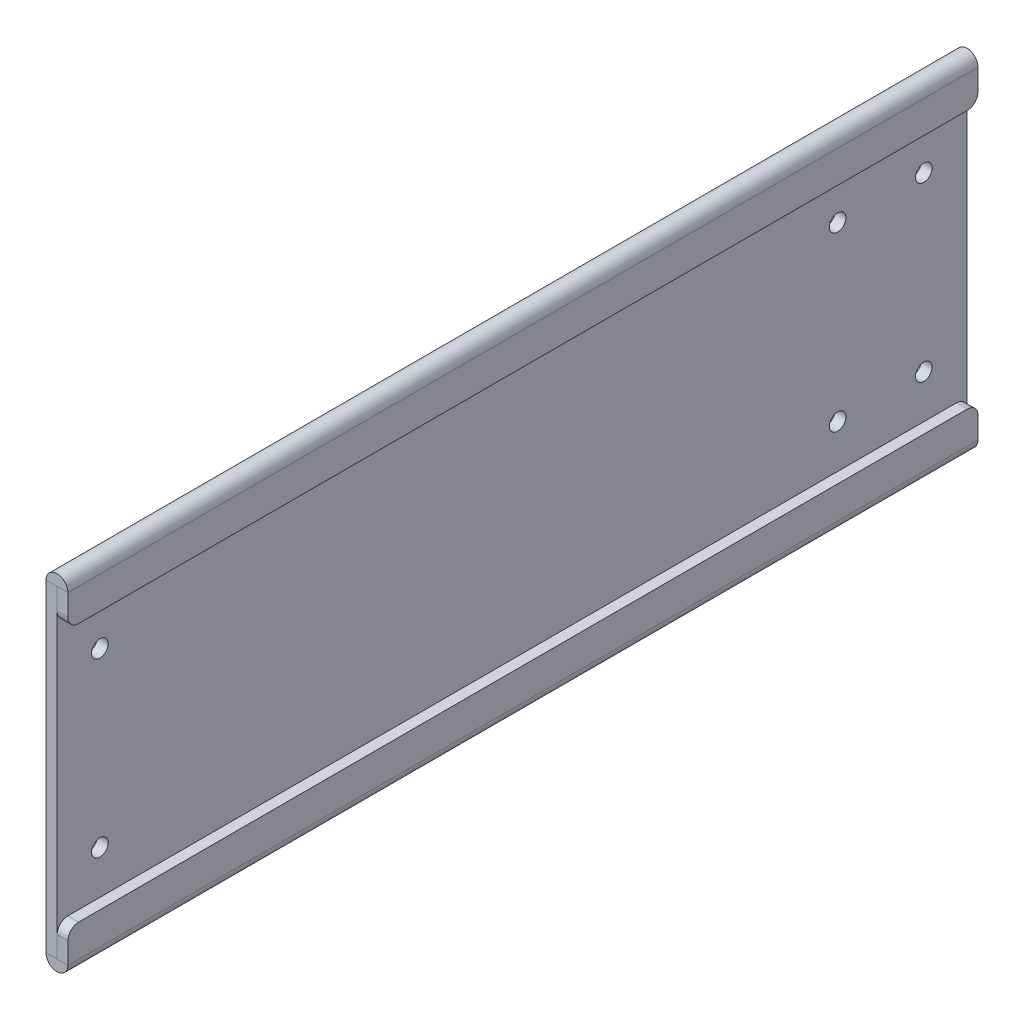
ISO-10303-21;
HEADER;
FILE_DESCRIPTION(('STEP AP214'),'2;1');
FILE_NAME('part.step','',(''),(''),'','','');
FILE_SCHEMA(('AUTOMOTIVE_DESIGN { 1 0 10303 214 1 1 1 1 }'));
ENDSEC;
DATA;
#1=APPLICATION_CONTEXT('core data for automotive mechanical design processes');
#2=APPLICATION_PROTOCOL_DEFINITION('international standard','automotive_design',2000,#1);
#3=PRODUCT_CONTEXT('',#1,'mechanical');
#4=PRODUCT('Part','Part','',(#3));
#5=PRODUCT_RELATED_PRODUCT_CATEGORY('part','',(#4));
#6=PRODUCT_DEFINITION_FORMATION('','',#4);
#7=PRODUCT_DEFINITION_CONTEXT('part definition',#1,'design');
#8=PRODUCT_DEFINITION('design','',#6,#7);
#9=PRODUCT_DEFINITION_SHAPE('','',#8);
#10=(LENGTH_UNIT() NAMED_UNIT(*) SI_UNIT(.MILLI.,.METRE.));
#11=(NAMED_UNIT(*) PLANE_ANGLE_UNIT() SI_UNIT($,.RADIAN.));
#12=(NAMED_UNIT(*) SI_UNIT($,.STERADIAN.) SOLID_ANGLE_UNIT());
#13=UNCERTAINTY_MEASURE_WITH_UNIT(LENGTH_MEASURE(1.E-05),#10,'distance_accuracy_value','');
#14=(GEOMETRIC_REPRESENTATION_CONTEXT(3) GLOBAL_UNCERTAINTY_ASSIGNED_CONTEXT((#13)) GLOBAL_UNIT_ASSIGNED_CONTEXT((#10,
#11,#12)) REPRESENTATION_CONTEXT('',''));
#15=CARTESIAN_POINT('',(0.,0.,0.));
#16=DIRECTION('',(0.,0.,1.));
#17=DIRECTION('',(1.,0.,0.));
#18=AXIS2_PLACEMENT_3D('',#15,#16,#17);
#19=CARTESIAN_POINT('',(0.,101.6,-268.22908));
#20=DIRECTION('',(0.,0.,-1.));
#21=DIRECTION('',(-1.,0.,0.));
#22=AXIS2_PLACEMENT_3D('',#19,#20,#21);
#23=PLANE('',#22);
#24=DIRECTION('',(0.,-1.,0.));
#25=VECTOR('',#24,1.);
#26=CARTESIAN_POINT('',(3.175,101.6,-268.22908));
#27=LINE('',#26,#25);
#28=CARTESIAN_POINT('',(3.175,98.375,-268.22908));
#29=VERTEX_POINT('',#28);
#30=CARTESIAN_POINT('',(3.175,3.22500000000001,-268.22908));
#31=VERTEX_POINT('',#30);
#32=EDGE_CURVE('E213',#29,#31,#27,.T.);
#33=ORIENTED_EDGE('',*,*,#32,.T.);
#34=DIRECTION('',(-1.,0.,0.));
#35=VECTOR('',#34,1.);
#36=CARTESIAN_POINT('',(3.175,3.225,-268.22908));
#37=LINE('',#36,#35);
#38=CARTESIAN_POINT('',(0.,3.22500000000003,-268.22908));
#39=VERTEX_POINT('',#38);
#40=EDGE_CURVE('E178',#31,#39,#37,.T.);
#41=ORIENTED_EDGE('',*,*,#40,.T.);
#42=DIRECTION('',(0.,-1.,0.));
#43=VECTOR('',#42,1.);
#44=CARTESIAN_POINT('',(0.,101.6,-268.22908));
#45=LINE('',#44,#43);
#46=CARTESIAN_POINT('',(0.,98.375,-268.22908));
#47=VERTEX_POINT('',#46);
#48=EDGE_CURVE('E198',#47,#39,#45,.T.);
#49=ORIENTED_EDGE('',*,*,#48,.F.);
#50=DIRECTION('',(-1.,0.,0.));
#51=VECTOR('',#50,1.);
#52=CARTESIAN_POINT('',(3.175,98.375,-268.22908));
#53=LINE('',#52,#51);
#54=EDGE_CURVE('E285',#29,#47,#53,.T.);
#55=ORIENTED_EDGE('',*,*,#54,.F.);
#56=EDGE_LOOP('',(#33,#41,#49,#55));
#57=FACE_BOUND('',#56,.T.);
#58=ADVANCED_FACE('F47',(#57),#23,.T.);
#59=CARTESIAN_POINT('',(3.175,101.6,0.));
#60=DIRECTION('',(0.,0.,1.));
#61=DIRECTION('',(1.,0.,0.));
#62=AXIS2_PLACEMENT_3D('',#59,#60,#61);
#63=PLANE('',#62);
#64=DIRECTION('',(-1.,0.,0.));
#65=VECTOR('',#64,1.);
#66=CARTESIAN_POINT('',(3.175,3.225,0.));
#67=LINE('',#66,#65);
#68=CARTESIAN_POINT('',(3.175,3.225,0.));
#69=VERTEX_POINT('',#68);
#70=CARTESIAN_POINT('',(0.,3.22500000000003,0.));
#71=VERTEX_POINT('',#70);
#72=EDGE_CURVE('E165',#69,#71,#67,.T.);
#73=ORIENTED_EDGE('',*,*,#72,.F.);
#74=DIRECTION('',(0.,-1.,0.));
#75=VECTOR('',#74,1.);
#76=CARTESIAN_POINT('',(3.175,101.6,0.));
#77=LINE('',#76,#75);
#78=CARTESIAN_POINT('',(3.175,98.375,0.));
#79=VERTEX_POINT('',#78);
#80=EDGE_CURVE('E208',#79,#69,#77,.T.);
#81=ORIENTED_EDGE('',*,*,#80,.F.);
#82=DIRECTION('',(-1.,0.,0.));
#83=VECTOR('',#82,1.);
#84=CARTESIAN_POINT('',(3.175,98.375,0.));
#85=LINE('',#84,#83);
#86=CARTESIAN_POINT('',(0.,98.375,0.));
#87=VERTEX_POINT('',#86);
#88=EDGE_CURVE('E206',#79,#87,#85,.T.);
#89=ORIENTED_EDGE('',*,*,#88,.T.);
#90=DIRECTION('',(0.,-1.,0.));
#91=VECTOR('',#90,1.);
#92=CARTESIAN_POINT('',(0.,101.6,0.));
#93=LINE('',#92,#91);
#94=EDGE_CURVE('E196',#87,#71,#93,.T.);
#95=ORIENTED_EDGE('',*,*,#94,.T.);
#96=EDGE_LOOP('',(#73,#81,#89,#95));
#97=FACE_BOUND('',#96,.T.);
#98=ADVANCED_FACE('F204',(#97),#63,.T.);
#99=CARTESIAN_POINT('',(3.175,101.6,0.));
#100=DIRECTION('',(-1.,0.,0.));
#101=DIRECTION('',(0.,0.,1.));
#102=AXIS2_PLACEMENT_3D('',#99,#100,#101);
#103=PLANE('',#102);
#104=CARTESIAN_POINT('',(3.175,25.35,-255.52908));
#105=DIRECTION('',(-1.,0.,0.));
#106=DIRECTION('',(0.,0.,1.));
#107=AXIS2_PLACEMENT_3D('',#104,#105,#106);
#108=CIRCLE('',#107,2.45745000000002);
#109=CARTESIAN_POINT('',(3.175,25.35,-253.07163));
#110=VERTEX_POINT('',#109);
#111=EDGE_CURVE('E410',#110,#110,#108,.T.);
#112=ORIENTED_EDGE('',*,*,#111,.T.);
#113=EDGE_LOOP('',(#112));
#114=FACE_BOUND('',#113,.T.);
#115=CARTESIAN_POINT('',(3.175,25.35,-230.12908));
#116=DIRECTION('',(-1.,0.,0.));
#117=DIRECTION('',(0.,0.,1.));
#118=AXIS2_PLACEMENT_3D('',#115,#116,#117);
#119=CIRCLE('',#118,2.45744999999999);
#120=CARTESIAN_POINT('',(3.175,25.35,-227.67163));
#121=VERTEX_POINT('',#120);
#122=EDGE_CURVE('E420',#121,#121,#119,.T.);
#123=ORIENTED_EDGE('',*,*,#122,.T.);
#124=EDGE_LOOP('',(#123));
#125=FACE_BOUND('',#124,.T.);
#126=CARTESIAN_POINT('',(3.175,76.15,-230.12908));
#127=DIRECTION('',(-1.,0.,0.));
#128=DIRECTION('',(0.,0.,1.));
#129=AXIS2_PLACEMENT_3D('',#126,#127,#128);
#130=CIRCLE('',#129,2.45744999999999);
#131=CARTESIAN_POINT('',(3.175,76.15,-227.67163));
#132=VERTEX_POINT('',#131);
#133=EDGE_CURVE('E424',#132,#132,#130,.T.);
#134=ORIENTED_EDGE('',*,*,#133,.T.);
#135=EDGE_LOOP('',(#134));
#136=FACE_BOUND('',#135,.T.);
#137=CARTESIAN_POINT('',(3.175,76.15,-12.7));
#138=DIRECTION('',(-1.,0.,0.));
#139=DIRECTION('',(0.,0.,1.));
#140=AXIS2_PLACEMENT_3D('',#137,#138,#139);
#141=CIRCLE('',#140,2.45745);
#142=CARTESIAN_POINT('',(3.175,76.15,-10.24255));
#143=VERTEX_POINT('',#142);
#144=EDGE_CURVE('E428',#143,#143,#141,.T.);
#145=ORIENTED_EDGE('',*,*,#144,.T.);
#146=EDGE_LOOP('',(#145));
#147=FACE_BOUND('',#146,.T.);
#148=CARTESIAN_POINT('',(3.175,25.35,-12.7));
#149=DIRECTION('',(-1.,0.,0.));
#150=DIRECTION('',(0.,0.,1.));
#151=AXIS2_PLACEMENT_3D('',#148,#149,#150);
#152=CIRCLE('',#151,2.45745);
#153=CARTESIAN_POINT('',(3.175,25.35,-10.24255));
#154=VERTEX_POINT('',#153);
#155=EDGE_CURVE('E432',#154,#154,#152,.T.);
#156=ORIENTED_EDGE('',*,*,#155,.T.);
#157=EDGE_LOOP('',(#156));
#158=FACE_BOUND('',#157,.T.);
#159=CARTESIAN_POINT('',(3.175,76.15,-255.52908));
#160=DIRECTION('',(-1.,0.,0.));
#161=DIRECTION('',(0.,0.,1.));
#162=AXIS2_PLACEMENT_3D('',#159,#160,#161);
#163=CIRCLE('',#162,2.45745000000002);
#164=CARTESIAN_POINT('',(3.175,76.15,-253.07163));
#165=VERTEX_POINT('',#164);
#166=EDGE_CURVE('E436',#165,#165,#163,.T.);
#167=ORIENTED_EDGE('',*,*,#166,.T.);
#168=EDGE_LOOP('',(#167));
#169=FACE_BOUND('',#168,.T.);
#170=ORIENTED_EDGE('',*,*,#80,.T.);
#171=DIRECTION('',(0.,0.,-1.));
#172=VECTOR('',#171,1.);
#173=CARTESIAN_POINT('',(3.175,3.225,-268.22908));
#174=LINE('',#173,#172);
#175=EDGE_CURVE('E409',#31,#69,#174,.F.);
#176=ORIENTED_EDGE('',*,*,#175,.F.);
#177=ORIENTED_EDGE('',*,*,#32,.F.);
#178=DIRECTION('',(0.,0.,1.));
#179=VECTOR('',#178,1.);
#180=CARTESIAN_POINT('',(3.175,98.375,0.));
#181=LINE('',#180,#179);
#182=EDGE_CURVE('E354',#79,#29,#181,.F.);
#183=ORIENTED_EDGE('',*,*,#182,.F.);
#184=EDGE_LOOP('',(#170,#176,#177,#183));
#185=FACE_BOUND('',#184,.T.);
#186=ADVANCED_FACE('F472',(#114,#125,#136,#147,#158,#169,#185),#103,.F.);
#187=CARTESIAN_POINT('',(0.,101.6,0.));
#188=DIRECTION('',(-1.,0.,0.));
#189=DIRECTION('',(0.,0.,1.));
#190=AXIS2_PLACEMENT_3D('',#187,#188,#189);
#191=PLANE('',#190);
#192=CARTESIAN_POINT('',(0.,25.35,-255.52908));
#193=DIRECTION('',(-1.,0.,0.));
#194=DIRECTION('',(0.,0.,1.));
#195=AXIS2_PLACEMENT_3D('',#192,#193,#194);
#196=CIRCLE('',#195,2.45745000000002);
#197=CARTESIAN_POINT('',(0.,25.35,-253.07163));
#198=VERTEX_POINT('',#197);
#199=EDGE_CURVE('E444',#198,#198,#196,.T.);
#200=ORIENTED_EDGE('',*,*,#199,.F.);
#201=EDGE_LOOP('',(#200));
#202=FACE_BOUND('',#201,.T.);
#203=CARTESIAN_POINT('',(0.,25.35,-230.12908));
#204=DIRECTION('',(-1.,0.,0.));
#205=DIRECTION('',(0.,0.,1.));
#206=AXIS2_PLACEMENT_3D('',#203,#204,#205);
#207=CIRCLE('',#206,2.45744999999999);
#208=CARTESIAN_POINT('',(0.,25.35,-227.67163));
#209=VERTEX_POINT('',#208);
#210=EDGE_CURVE('E454',#209,#209,#207,.T.);
#211=ORIENTED_EDGE('',*,*,#210,.F.);
#212=EDGE_LOOP('',(#211));
#213=FACE_BOUND('',#212,.T.);
#214=CARTESIAN_POINT('',(0.,76.15,-230.12908));
#215=DIRECTION('',(-1.,0.,0.));
#216=DIRECTION('',(0.,0.,1.));
#217=AXIS2_PLACEMENT_3D('',#214,#215,#216);
#218=CIRCLE('',#217,2.45744999999999);
#219=CARTESIAN_POINT('',(0.,76.15,-227.67163));
#220=VERTEX_POINT('',#219);
#221=EDGE_CURVE('E449',#220,#220,#218,.T.);
#222=ORIENTED_EDGE('',*,*,#221,.F.);
#223=EDGE_LOOP('',(#222));
#224=FACE_BOUND('',#223,.T.);
#225=CARTESIAN_POINT('',(0.,76.15,-12.7));
#226=DIRECTION('',(-1.,0.,0.));
#227=DIRECTION('',(0.,0.,1.));
#228=AXIS2_PLACEMENT_3D('',#225,#226,#227);
#229=CIRCLE('',#228,2.45745);
#230=CARTESIAN_POINT('',(0.,76.15,-10.24255));
#231=VERTEX_POINT('',#230);
#232=EDGE_CURVE('E445',#231,#231,#229,.T.);
#233=ORIENTED_EDGE('',*,*,#232,.F.);
#234=EDGE_LOOP('',(#233));
#235=FACE_BOUND('',#234,.T.);
#236=CARTESIAN_POINT('',(0.,25.35,-12.7));
#237=DIRECTION('',(-1.,0.,0.));
#238=DIRECTION('',(0.,0.,1.));
#239=AXIS2_PLACEMENT_3D('',#236,#237,#238);
#240=CIRCLE('',#239,2.45745);
#241=CARTESIAN_POINT('',(0.,25.35,-10.24255));
#242=VERTEX_POINT('',#241);
#243=EDGE_CURVE('E450',#242,#242,#240,.T.);
#244=ORIENTED_EDGE('',*,*,#243,.F.);
#245=EDGE_LOOP('',(#244));
#246=FACE_BOUND('',#245,.T.);
#247=CARTESIAN_POINT('',(0.,76.15,-255.52908));
#248=DIRECTION('',(-1.,0.,0.));
#249=DIRECTION('',(0.,0.,1.));
#250=AXIS2_PLACEMENT_3D('',#247,#248,#249);
#251=CIRCLE('',#250,2.45745000000002);
#252=CARTESIAN_POINT('',(0.,76.15,-253.07163));
#253=VERTEX_POINT('',#252);
#254=EDGE_CURVE('E440',#253,#253,#251,.T.);
#255=ORIENTED_EDGE('',*,*,#254,.F.);
#256=EDGE_LOOP('',(#255));
#257=FACE_BOUND('',#256,.T.);
#258=DIRECTION('',(0.,0.,-1.));
#259=VECTOR('',#258,1.);
#260=CARTESIAN_POINT('',(0.,3.22500000000003,-268.22908));
#261=LINE('',#260,#259);
#262=EDGE_CURVE('E185',#39,#71,#261,.F.);
#263=ORIENTED_EDGE('',*,*,#262,.T.);
#264=ORIENTED_EDGE('',*,*,#94,.F.);
#265=DIRECTION('',(0.,0.,1.));
#266=VECTOR('',#265,1.);
#267=CARTESIAN_POINT('',(0.,98.375,0.));
#268=LINE('',#267,#266);
#269=EDGE_CURVE('E341',#87,#47,#268,.F.);
#270=ORIENTED_EDGE('',*,*,#269,.T.);
#271=ORIENTED_EDGE('',*,*,#48,.T.);
#272=EDGE_LOOP('',(#263,#264,#270,#271));
#273=FACE_BOUND('',#272,.T.);
#274=ADVANCED_FACE('F194',(#202,#213,#224,#235,#246,#257,#273),#191,.T.);
#275=CARTESIAN_POINT('',(6.45,93.6375,0.));
#276=DIRECTION('',(0.,0.,-1.));
#277=DIRECTION('',(0.,1.,0.));
#278=AXIS2_PLACEMENT_3D('',#275,#276,#277);
#279=PLANE('',#278);
#280=DIRECTION('',(0.,1.,0.));
#281=VECTOR('',#280,1.);
#282=CARTESIAN_POINT('',(3.275,93.6375,0.));
#283=LINE('',#282,#281);
#284=CARTESIAN_POINT('',(3.275,92.075,0.));
#285=VERTEX_POINT('',#284);
#286=CARTESIAN_POINT('',(3.275,98.375,0.));
#287=VERTEX_POINT('',#286);
#288=EDGE_CURVE('E320',#285,#287,#283,.T.);
#289=ORIENTED_EDGE('',*,*,#288,.F.);
#290=DIRECTION('',(-1.,0.,0.));
#291=VECTOR('',#290,1.);
#292=CARTESIAN_POINT('',(6.45,92.075,0.));
#293=LINE('',#292,#291);
#294=CARTESIAN_POINT('',(6.45,92.075,0.));
#295=VERTEX_POINT('',#294);
#296=EDGE_CURVE('E222',#285,#295,#293,.F.);
#297=ORIENTED_EDGE('',*,*,#296,.T.);
#298=DIRECTION('',(0.,1.,0.));
#299=VECTOR('',#298,1.);
#300=CARTESIAN_POINT('',(6.45,93.6375,0.));
#301=LINE('',#300,#299);
#302=CARTESIAN_POINT('',(6.45,98.375,0.));
#303=VERTEX_POINT('',#302);
#304=EDGE_CURVE('E301',#295,#303,#301,.T.);
#305=ORIENTED_EDGE('',*,*,#304,.T.);
#306=DIRECTION('',(1.,0.,0.));
#307=VECTOR('',#306,1.);
#308=CARTESIAN_POINT('',(6.45,98.375,0.));
#309=LINE('',#308,#307);
#310=EDGE_CURVE('E300',#287,#303,#309,.T.);
#311=ORIENTED_EDGE('',*,*,#310,.F.);
#312=EDGE_LOOP('',(#289,#297,#305,#311));
#313=FACE_BOUND('',#312,.T.);
#314=ADVANCED_FACE('F471',(#313),#279,.F.);
#315=CARTESIAN_POINT('',(6.45,88.9,-134.11454));
#316=DIRECTION('',(0.,1.,0.));
#317=DIRECTION('',(0.,0.,1.));
#318=AXIS2_PLACEMENT_3D('',#315,#316,#317);
#319=PLANE('',#318);
#320=DIRECTION('',(0.,0.,1.));
#321=VECTOR('',#320,1.);
#322=CARTESIAN_POINT('',(6.45,88.9,-134.11454));
#323=LINE('',#322,#321);
#324=CARTESIAN_POINT('',(6.45,88.9,-265.05408));
#325=VERTEX_POINT('',#324);
#326=CARTESIAN_POINT('',(6.45,88.9,-3.17500000000001));
#327=VERTEX_POINT('',#326);
#328=EDGE_CURVE('E293',#325,#327,#323,.T.);
#329=ORIENTED_EDGE('',*,*,#328,.T.);
#330=DIRECTION('',(-1.,0.,0.));
#331=VECTOR('',#330,1.);
#332=CARTESIAN_POINT('',(6.45,88.9,-3.17500000000001));
#333=LINE('',#332,#331);
#334=CARTESIAN_POINT('',(3.275,88.9,-3.17500000000001));
#335=VERTEX_POINT('',#334);
#336=EDGE_CURVE('E236',#327,#335,#333,.T.);
#337=ORIENTED_EDGE('',*,*,#336,.T.);
#338=DIRECTION('',(0.,0.,-1.));
#339=VECTOR('',#338,1.);
#340=CARTESIAN_POINT('',(3.275,88.9,-134.11454));
#341=LINE('',#340,#339);
#342=CARTESIAN_POINT('',(3.275,88.9,-265.05408));
#343=VERTEX_POINT('',#342);
#344=EDGE_CURVE('E295',#343,#335,#341,.F.);
#345=ORIENTED_EDGE('',*,*,#344,.F.);
#346=DIRECTION('',(-1.,0.,0.));
#347=VECTOR('',#346,1.);
#348=CARTESIAN_POINT('',(6.45,88.9,-265.05408));
#349=LINE('',#348,#347);
#350=EDGE_CURVE('E232',#343,#325,#349,.F.);
#351=ORIENTED_EDGE('',*,*,#350,.T.);
#352=EDGE_LOOP('',(#329,#337,#345,#351));
#353=FACE_BOUND('',#352,.T.);
#354=ADVANCED_FACE('F292',(#353),#319,.F.);
#355=CARTESIAN_POINT('',(6.45,93.6375,-268.22908));
#356=DIRECTION('',(0.,0.,1.));
#357=DIRECTION('',(0.,-1.,0.));
#358=AXIS2_PLACEMENT_3D('',#355,#356,#357);
#359=PLANE('',#358);
#360=DIRECTION('',(0.,-1.,0.));
#361=VECTOR('',#360,1.);
#362=CARTESIAN_POINT('',(6.45,93.6375,-268.22908));
#363=LINE('',#362,#361);
#364=CARTESIAN_POINT('',(6.45,98.375,-268.22908));
#365=VERTEX_POINT('',#364);
#366=CARTESIAN_POINT('',(6.45,92.075,-268.22908));
#367=VERTEX_POINT('',#366);
#368=EDGE_CURVE('E275',#365,#367,#363,.T.);
#369=ORIENTED_EDGE('',*,*,#368,.T.);
#370=DIRECTION('',(-1.,0.,0.));
#371=VECTOR('',#370,1.);
#372=CARTESIAN_POINT('',(6.45,92.075,-268.22908));
#373=LINE('',#372,#371);
#374=CARTESIAN_POINT('',(3.275,92.075,-268.22908));
#375=VERTEX_POINT('',#374);
#376=EDGE_CURVE('E56',#367,#375,#373,.T.);
#377=ORIENTED_EDGE('',*,*,#376,.T.);
#378=DIRECTION('',(0.,1.,0.));
#379=VECTOR('',#378,1.);
#380=CARTESIAN_POINT('',(3.275,93.6375,-268.22908));
#381=LINE('',#380,#379);
#382=CARTESIAN_POINT('',(3.275,98.375,-268.22908));
#383=VERTEX_POINT('',#382);
#384=EDGE_CURVE('E273',#383,#375,#381,.F.);
#385=ORIENTED_EDGE('',*,*,#384,.F.);
#386=DIRECTION('',(1.,0.,0.));
#387=VECTOR('',#386,1.);
#388=CARTESIAN_POINT('',(6.45,98.375,-268.22908));
#389=LINE('',#388,#387);
#390=EDGE_CURVE('E215',#383,#365,#389,.T.);
#391=ORIENTED_EDGE('',*,*,#390,.T.);
#392=EDGE_LOOP('',(#369,#377,#385,#391));
#393=FACE_BOUND('',#392,.T.);
#394=ADVANCED_FACE('F271',(#393),#359,.F.);
#395=CARTESIAN_POINT('',(6.45,93.6375,-134.11454));
#396=DIRECTION('',(1.,0.,0.));
#397=DIRECTION('',(0.,0.,-1.));
#398=AXIS2_PLACEMENT_3D('',#395,#396,#397);
#399=PLANE('',#398);
#400=ORIENTED_EDGE('',*,*,#304,.F.);
#401=CARTESIAN_POINT('',(6.45,92.075,-3.175));
#402=DIRECTION('',(1.,0.,0.));
#403=DIRECTION('',(0.,0.,-1.));
#404=AXIS2_PLACEMENT_3D('',#401,#402,#403);
#405=CIRCLE('',#404,3.175);
#406=EDGE_CURVE('E229',#295,#327,#405,.T.);
#407=ORIENTED_EDGE('',*,*,#406,.T.);
#408=ORIENTED_EDGE('',*,*,#328,.F.);
#409=CARTESIAN_POINT('',(6.45,92.075,-265.05408));
#410=DIRECTION('',(1.,0.,0.));
#411=DIRECTION('',(0.,0.,-1.));
#412=AXIS2_PLACEMENT_3D('',#409,#410,#411);
#413=CIRCLE('',#412,3.175);
#414=EDGE_CURVE('E226',#325,#367,#413,.T.);
#415=ORIENTED_EDGE('',*,*,#414,.T.);
#416=ORIENTED_EDGE('',*,*,#368,.F.);
#417=DIRECTION('',(0.,0.,-1.));
#418=VECTOR('',#417,1.);
#419=CARTESIAN_POINT('',(6.45,98.375,-134.11454));
#420=LINE('',#419,#418);
#421=EDGE_CURVE('E308',#303,#365,#420,.T.);
#422=ORIENTED_EDGE('',*,*,#421,.F.);
#423=EDGE_LOOP('',(#400,#407,#408,#415,#416,#422));
#424=FACE_BOUND('',#423,.T.);
#425=ADVANCED_FACE('F298',(#424),#399,.T.);
#426=CARTESIAN_POINT('',(3.275,93.6375,-134.11454));
#427=DIRECTION('',(1.,0.,0.));
#428=DIRECTION('',(0.,0.,-1.));
#429=AXIS2_PLACEMENT_3D('',#426,#427,#428);
#430=PLANE('',#429);
#431=ORIENTED_EDGE('',*,*,#344,.T.);
#432=CARTESIAN_POINT('',(3.275,92.075,-3.175));
#433=DIRECTION('',(1.,0.,0.));
#434=DIRECTION('',(0.,0.,-1.));
#435=AXIS2_PLACEMENT_3D('',#432,#433,#434);
#436=CIRCLE('',#435,3.175);
#437=EDGE_CURVE('E242',#335,#285,#436,.F.);
#438=ORIENTED_EDGE('',*,*,#437,.T.);
#439=ORIENTED_EDGE('',*,*,#288,.T.);
#440=DIRECTION('',(0.,0.,-1.));
#441=VECTOR('',#440,1.);
#442=CARTESIAN_POINT('',(3.275,98.375,-134.11454));
#443=LINE('',#442,#441);
#444=EDGE_CURVE('E283',#287,#383,#443,.T.);
#445=ORIENTED_EDGE('',*,*,#444,.T.);
#446=ORIENTED_EDGE('',*,*,#384,.T.);
#447=CARTESIAN_POINT('',(3.275,92.075,-265.05408));
#448=DIRECTION('',(1.,0.,0.));
#449=DIRECTION('',(0.,0.,-1.));
#450=AXIS2_PLACEMENT_3D('',#447,#448,#449);
#451=CIRCLE('',#450,3.175);
#452=EDGE_CURVE('E239',#375,#343,#451,.F.);
#453=ORIENTED_EDGE('',*,*,#452,.T.);
#454=EDGE_LOOP('',(#431,#438,#439,#445,#446,#453));
#455=FACE_BOUND('',#454,.T.);
#456=ADVANCED_FACE('F280',(#455),#430,.F.);
#457=CARTESIAN_POINT('',(3.225,98.375,-268.22908));
#458=DIRECTION('',(0.,0.,-1.));
#459=DIRECTION('',(-1.,0.,0.));
#460=AXIS2_PLACEMENT_3D('',#457,#458,#459);
#461=PLANE('',#460);
#462=ORIENTED_EDGE('',*,*,#390,.F.);
#463=CARTESIAN_POINT('',(3.225,98.375,-268.22908));
#464=DIRECTION('',(0.,0.,1.));
#465=DIRECTION('',(1.,0.,0.));
#466=AXIS2_PLACEMENT_3D('',#463,#464,#465);
#467=CIRCLE('',#466,0.0499999999999997);
#468=EDGE_CURVE('E351',#29,#383,#467,.F.);
#469=ORIENTED_EDGE('',*,*,#468,.F.);
#470=ORIENTED_EDGE('',*,*,#54,.T.);
#471=CARTESIAN_POINT('',(3.225,98.375,-268.22908));
#472=DIRECTION('',(0.,0.,1.));
#473=DIRECTION('',(1.,0.,0.));
#474=AXIS2_PLACEMENT_3D('',#471,#472,#473);
#475=CIRCLE('',#474,3.225);
#476=EDGE_CURVE('E335',#47,#365,#475,.F.);
#477=ORIENTED_EDGE('',*,*,#476,.T.);
#478=EDGE_LOOP('',(#462,#469,#470,#477));
#479=FACE_BOUND('',#478,.T.);
#480=ADVANCED_FACE('F338',(#479),#461,.T.);
#481=CARTESIAN_POINT('',(3.225,98.375,0.));
#482=DIRECTION('',(0.,0.,-1.));
#483=DIRECTION('',(-1.,0.,0.));
#484=AXIS2_PLACEMENT_3D('',#481,#482,#483);
#485=PLANE('',#484);
#486=CARTESIAN_POINT('',(3.225,98.375,0.));
#487=DIRECTION('',(0.,0.,1.));
#488=DIRECTION('',(1.,0.,0.));
#489=AXIS2_PLACEMENT_3D('',#486,#487,#488);
#490=CIRCLE('',#489,0.0499999999999997);
#491=EDGE_CURVE('E357',#287,#79,#490,.T.);
#492=ORIENTED_EDGE('',*,*,#491,.F.);
#493=ORIENTED_EDGE('',*,*,#310,.T.);
#494=CARTESIAN_POINT('',(3.225,98.375,0.));
#495=DIRECTION('',(0.,0.,1.));
#496=DIRECTION('',(1.,0.,0.));
#497=AXIS2_PLACEMENT_3D('',#494,#495,#496);
#498=CIRCLE('',#497,3.225);
#499=EDGE_CURVE('E337',#303,#87,#498,.T.);
#500=ORIENTED_EDGE('',*,*,#499,.T.);
#501=ORIENTED_EDGE('',*,*,#88,.F.);
#502=EDGE_LOOP('',(#492,#493,#500,#501));
#503=FACE_BOUND('',#502,.T.);
#504=ADVANCED_FACE('F776',(#503),#485,.F.);
#505=CARTESIAN_POINT('',(3.225,98.375,0.));
#506=DIRECTION('',(0.,0.,1.));
#507=DIRECTION('',(1.,0.,0.));
#508=AXIS2_PLACEMENT_3D('',#505,#506,#507);
#509=CYLINDRICAL_SURFACE('',#508,3.225);
#510=ORIENTED_EDGE('',*,*,#269,.F.);
#511=ORIENTED_EDGE('',*,*,#499,.F.);
#512=ORIENTED_EDGE('',*,*,#421,.T.);
#513=ORIENTED_EDGE('',*,*,#476,.F.);
#514=EDGE_LOOP('',(#510,#511,#512,#513));
#515=FACE_BOUND('',#514,.T.);
#516=ADVANCED_FACE('F334',(#515),#509,.T.);
#517=CARTESIAN_POINT('',(3.225,98.375,0.));
#518=DIRECTION('',(0.,0.,1.));
#519=DIRECTION('',(1.,0.,0.));
#520=AXIS2_PLACEMENT_3D('',#517,#518,#519);
#521=CYLINDRICAL_SURFACE('',#520,0.0499999999999997);
#522=ORIENTED_EDGE('',*,*,#182,.T.);
#523=ORIENTED_EDGE('',*,*,#468,.T.);
#524=ORIENTED_EDGE('',*,*,#444,.F.);
#525=ORIENTED_EDGE('',*,*,#491,.T.);
#526=EDGE_LOOP('',(#522,#523,#524,#525));
#527=FACE_BOUND('',#526,.T.);
#528=ADVANCED_FACE('F491',(#527),#521,.F.);
#529=CARTESIAN_POINT('',(6.45,7.9625,-268.22908));
#530=DIRECTION('',(0.,0.,1.));
#531=DIRECTION('',(0.,-1.,0.));
#532=AXIS2_PLACEMENT_3D('',#529,#530,#531);
#533=PLANE('',#532);
#534=DIRECTION('',(0.,1.,0.));
#535=VECTOR('',#534,1.);
#536=CARTESIAN_POINT('',(3.275,7.9625,-268.22908));
#537=LINE('',#536,#535);
#538=CARTESIAN_POINT('',(3.275,9.525,-268.22908));
#539=VERTEX_POINT('',#538);
#540=CARTESIAN_POINT('',(3.275,3.225,-268.22908));
#541=VERTEX_POINT('',#540);
#542=EDGE_CURVE('E387',#539,#541,#537,.F.);
#543=ORIENTED_EDGE('',*,*,#542,.F.);
#544=DIRECTION('',(-1.,0.,0.));
#545=VECTOR('',#544,1.);
#546=CARTESIAN_POINT('',(6.45,9.525,-268.22908));
#547=LINE('',#546,#545);
#548=CARTESIAN_POINT('',(6.45,9.525,-268.22908));
#549=VERTEX_POINT('',#548);
#550=EDGE_CURVE('E11',#539,#549,#547,.F.);
#551=ORIENTED_EDGE('',*,*,#550,.T.);
#552=DIRECTION('',(0.,-1.,0.));
#553=VECTOR('',#552,1.);
#554=CARTESIAN_POINT('',(6.45,7.9625,-268.22908));
#555=LINE('',#554,#553);
#556=CARTESIAN_POINT('',(6.45,3.225,-268.22908));
#557=VERTEX_POINT('',#556);
#558=EDGE_CURVE('E398',#549,#557,#555,.T.);
#559=ORIENTED_EDGE('',*,*,#558,.T.);
#560=DIRECTION('',(1.,0.,0.));
#561=VECTOR('',#560,1.);
#562=CARTESIAN_POINT('',(6.45,3.225,-268.22908));
#563=LINE('',#562,#561);
#564=EDGE_CURVE('E375',#541,#557,#563,.T.);
#565=ORIENTED_EDGE('',*,*,#564,.F.);
#566=EDGE_LOOP('',(#543,#551,#559,#565));
#567=FACE_BOUND('',#566,.T.);
#568=ADVANCED_FACE('F500',(#567),#533,.F.);
#569=CARTESIAN_POINT('',(6.45,12.7,-134.11454));
#570=DIRECTION('',(0.,-1.,0.));
#571=DIRECTION('',(0.,0.,-1.));
#572=AXIS2_PLACEMENT_3D('',#569,#570,#571);
#573=PLANE('',#572);
#574=DIRECTION('',(0.,0.,-1.));
#575=VECTOR('',#574,1.);
#576=CARTESIAN_POINT('',(3.275,12.7,-134.11454));
#577=LINE('',#576,#575);
#578=CARTESIAN_POINT('',(3.275,12.7,-3.17500000000001));
#579=VERTEX_POINT('',#578);
#580=CARTESIAN_POINT('',(3.275,12.7,-265.05408));
#581=VERTEX_POINT('',#580);
#582=EDGE_CURVE('E390',#579,#581,#577,.T.);
#583=ORIENTED_EDGE('',*,*,#582,.F.);
#584=DIRECTION('',(-1.,0.,0.));
#585=VECTOR('',#584,1.);
#586=CARTESIAN_POINT('',(6.45,12.7,-3.17500000000001));
#587=LINE('',#586,#585);
#588=CARTESIAN_POINT('',(6.45,12.7,-3.17500000000001));
#589=VERTEX_POINT('',#588);
#590=EDGE_CURVE('E248',#579,#589,#587,.F.);
#591=ORIENTED_EDGE('',*,*,#590,.T.);
#592=DIRECTION('',(0.,0.,-1.));
#593=VECTOR('',#592,1.);
#594=CARTESIAN_POINT('',(6.45,12.7,-134.11454));
#595=LINE('',#594,#593);
#596=CARTESIAN_POINT('',(6.45,12.7,-265.05408));
#597=VERTEX_POINT('',#596);
#598=EDGE_CURVE('E379',#589,#597,#595,.T.);
#599=ORIENTED_EDGE('',*,*,#598,.T.);
#600=DIRECTION('',(-1.,0.,0.));
#601=VECTOR('',#600,1.);
#602=CARTESIAN_POINT('',(6.45,12.7,-265.05408));
#603=LINE('',#602,#601);
#604=EDGE_CURVE('E245',#597,#581,#603,.T.);
#605=ORIENTED_EDGE('',*,*,#604,.T.);
#606=EDGE_LOOP('',(#583,#591,#599,#605));
#607=FACE_BOUND('',#606,.T.);
#608=ADVANCED_FACE('F509',(#607),#573,.F.);
#609=CARTESIAN_POINT('',(6.45,7.9625,0.));
#610=DIRECTION('',(0.,0.,-1.));
#611=DIRECTION('',(0.,1.,0.));
#612=AXIS2_PLACEMENT_3D('',#609,#610,#611);
#613=PLANE('',#612);
#614=DIRECTION('',(0.,1.,0.));
#615=VECTOR('',#614,1.);
#616=CARTESIAN_POINT('',(6.45,7.9625,0.));
#617=LINE('',#616,#615);
#618=CARTESIAN_POINT('',(6.45,3.225,0.));
#619=VERTEX_POINT('',#618);
#620=CARTESIAN_POINT('',(6.45,9.525,0.));
#621=VERTEX_POINT('',#620);
#622=EDGE_CURVE('E393',#619,#621,#617,.T.);
#623=ORIENTED_EDGE('',*,*,#622,.T.);
#624=DIRECTION('',(-1.,0.,0.));
#625=VECTOR('',#624,1.);
#626=CARTESIAN_POINT('',(6.45,9.525,0.));
#627=LINE('',#626,#625);
#628=CARTESIAN_POINT('',(3.275,9.525,0.));
#629=VERTEX_POINT('',#628);
#630=EDGE_CURVE('E71',#621,#629,#627,.T.);
#631=ORIENTED_EDGE('',*,*,#630,.T.);
#632=DIRECTION('',(0.,1.,0.));
#633=VECTOR('',#632,1.);
#634=CARTESIAN_POINT('',(3.275,7.9625,0.));
#635=LINE('',#634,#633);
#636=CARTESIAN_POINT('',(3.275,3.225,0.));
#637=VERTEX_POINT('',#636);
#638=EDGE_CURVE('E177',#637,#629,#635,.T.);
#639=ORIENTED_EDGE('',*,*,#638,.F.);
#640=DIRECTION('',(1.,0.,0.));
#641=VECTOR('',#640,1.);
#642=CARTESIAN_POINT('',(6.45,3.225,0.));
#643=LINE('',#642,#641);
#644=EDGE_CURVE('E359',#637,#619,#643,.T.);
#645=ORIENTED_EDGE('',*,*,#644,.T.);
#646=EDGE_LOOP('',(#623,#631,#639,#645));
#647=FACE_BOUND('',#646,.T.);
#648=ADVANCED_FACE('F506',(#647),#613,.F.);
#649=CARTESIAN_POINT('',(6.45,7.9625,-134.11454));
#650=DIRECTION('',(1.,0.,0.));
#651=DIRECTION('',(0.,0.,-1.));
#652=AXIS2_PLACEMENT_3D('',#649,#650,#651);
#653=PLANE('',#652);
#654=ORIENTED_EDGE('',*,*,#598,.F.);
#655=CARTESIAN_POINT('',(6.45,9.525,-3.17500000000001));
#656=DIRECTION('',(1.,0.,0.));
#657=DIRECTION('',(0.,0.,-1.));
#658=AXIS2_PLACEMENT_3D('',#655,#656,#657);
#659=CIRCLE('',#658,3.175);
#660=EDGE_CURVE('E255',#589,#621,#659,.T.);
#661=ORIENTED_EDGE('',*,*,#660,.T.);
#662=ORIENTED_EDGE('',*,*,#622,.F.);
#663=DIRECTION('',(0.,0.,1.));
#664=VECTOR('',#663,1.);
#665=CARTESIAN_POINT('',(6.45,3.225,-134.11454));
#666=LINE('',#665,#664);
#667=EDGE_CURVE('E188',#557,#619,#666,.T.);
#668=ORIENTED_EDGE('',*,*,#667,.F.);
#669=ORIENTED_EDGE('',*,*,#558,.F.);
#670=CARTESIAN_POINT('',(6.45,9.525,-265.05408));
#671=DIRECTION('',(1.,0.,0.));
#672=DIRECTION('',(0.,0.,-1.));
#673=AXIS2_PLACEMENT_3D('',#670,#671,#672);
#674=CIRCLE('',#673,3.175);
#675=EDGE_CURVE('E252',#549,#597,#674,.T.);
#676=ORIENTED_EDGE('',*,*,#675,.T.);
#677=EDGE_LOOP('',(#654,#661,#662,#668,#669,#676));
#678=FACE_BOUND('',#677,.T.);
#679=ADVANCED_FACE('F508',(#678),#653,.T.);
#680=CARTESIAN_POINT('',(3.275,7.9625,-134.11454));
#681=DIRECTION('',(1.,0.,0.));
#682=DIRECTION('',(0.,0.,-1.));
#683=AXIS2_PLACEMENT_3D('',#680,#681,#682);
#684=PLANE('',#683);
#685=ORIENTED_EDGE('',*,*,#638,.T.);
#686=CARTESIAN_POINT('',(3.275,9.525,-3.17500000000001));
#687=DIRECTION('',(1.,0.,0.));
#688=DIRECTION('',(0.,0.,-1.));
#689=AXIS2_PLACEMENT_3D('',#686,#687,#688);
#690=CIRCLE('',#689,3.175);
#691=EDGE_CURVE('E262',#629,#579,#690,.F.);
#692=ORIENTED_EDGE('',*,*,#691,.T.);
#693=ORIENTED_EDGE('',*,*,#582,.T.);
#694=CARTESIAN_POINT('',(3.275,9.525,-265.05408));
#695=DIRECTION('',(1.,0.,0.));
#696=DIRECTION('',(0.,0.,-1.));
#697=AXIS2_PLACEMENT_3D('',#694,#695,#696);
#698=CIRCLE('',#697,3.175);
#699=EDGE_CURVE('E63',#581,#539,#698,.F.);
#700=ORIENTED_EDGE('',*,*,#699,.T.);
#701=ORIENTED_EDGE('',*,*,#542,.T.);
#702=DIRECTION('',(0.,0.,-1.));
#703=VECTOR('',#702,1.);
#704=CARTESIAN_POINT('',(3.275,3.225,-134.11454));
#705=LINE('',#704,#703);
#706=EDGE_CURVE('E384',#541,#637,#705,.F.);
#707=ORIENTED_EDGE('',*,*,#706,.T.);
#708=EDGE_LOOP('',(#685,#692,#693,#700,#701,#707));
#709=FACE_BOUND('',#708,.T.);
#710=ADVANCED_FACE('F504',(#709),#684,.F.);
#711=CARTESIAN_POINT('',(3.225,3.225,0.));
#712=DIRECTION('',(0.,0.,1.));
#713=DIRECTION('',(1.,0.,0.));
#714=AXIS2_PLACEMENT_3D('',#711,#712,#713);
#715=PLANE('',#714);
#716=ORIENTED_EDGE('',*,*,#644,.F.);
#717=CARTESIAN_POINT('',(3.225,3.225,0.));
#718=DIRECTION('',(0.,0.,-1.));
#719=DIRECTION('',(-1.,0.,0.));
#720=AXIS2_PLACEMENT_3D('',#717,#718,#719);
#721=CIRCLE('',#720,0.0499999999999997);
#722=EDGE_CURVE('E171',#69,#637,#721,.F.);
#723=ORIENTED_EDGE('',*,*,#722,.F.);
#724=ORIENTED_EDGE('',*,*,#72,.T.);
#725=CARTESIAN_POINT('',(3.225,3.225,0.));
#726=DIRECTION('',(0.,0.,-1.));
#727=DIRECTION('',(-1.,0.,0.));
#728=AXIS2_PLACEMENT_3D('',#725,#726,#727);
#729=CIRCLE('',#728,3.225);
#730=EDGE_CURVE('E169',#71,#619,#729,.F.);
#731=ORIENTED_EDGE('',*,*,#730,.T.);
#732=EDGE_LOOP('',(#716,#723,#724,#731));
#733=FACE_BOUND('',#732,.T.);
#734=ADVANCED_FACE('F168',(#733),#715,.T.);
#735=CARTESIAN_POINT('',(3.225,3.225,-268.22908));
#736=DIRECTION('',(0.,0.,1.));
#737=DIRECTION('',(1.,0.,0.));
#738=AXIS2_PLACEMENT_3D('',#735,#736,#737);
#739=PLANE('',#738);
#740=CARTESIAN_POINT('',(3.225,3.225,-268.22908));
#741=DIRECTION('',(0.,0.,-1.));
#742=DIRECTION('',(-1.,0.,0.));
#743=AXIS2_PLACEMENT_3D('',#740,#741,#742);
#744=CIRCLE('',#743,0.0499999999999997);
#745=EDGE_CURVE('E406',#541,#31,#744,.T.);
#746=ORIENTED_EDGE('',*,*,#745,.F.);
#747=ORIENTED_EDGE('',*,*,#564,.T.);
#748=CARTESIAN_POINT('',(3.225,3.225,-268.22908));
#749=DIRECTION('',(0.,0.,-1.));
#750=DIRECTION('',(-1.,0.,0.));
#751=AXIS2_PLACEMENT_3D('',#748,#749,#750);
#752=CIRCLE('',#751,3.225);
#753=EDGE_CURVE('E201',#557,#39,#752,.T.);
#754=ORIENTED_EDGE('',*,*,#753,.T.);
#755=ORIENTED_EDGE('',*,*,#40,.F.);
#756=EDGE_LOOP('',(#746,#747,#754,#755));
#757=FACE_BOUND('',#756,.T.);
#758=ADVANCED_FACE('F496',(#757),#739,.F.);
#759=CARTESIAN_POINT('',(3.225,3.225,-268.22908));
#760=DIRECTION('',(0.,0.,-1.));
#761=DIRECTION('',(1.,0.,0.));
#762=AXIS2_PLACEMENT_3D('',#759,#760,#761);
#763=CYLINDRICAL_SURFACE('',#762,3.225);
#764=ORIENTED_EDGE('',*,*,#262,.F.);
#765=ORIENTED_EDGE('',*,*,#753,.F.);
#766=ORIENTED_EDGE('',*,*,#667,.T.);
#767=ORIENTED_EDGE('',*,*,#730,.F.);
#768=EDGE_LOOP('',(#764,#765,#766,#767));
#769=FACE_BOUND('',#768,.T.);
#770=ADVANCED_FACE('F183',(#769),#763,.T.);
#771=CARTESIAN_POINT('',(3.225,3.225,-268.22908));
#772=DIRECTION('',(0.,0.,-1.));
#773=DIRECTION('',(1.,0.,0.));
#774=AXIS2_PLACEMENT_3D('',#771,#772,#773);
#775=CYLINDRICAL_SURFACE('',#774,0.0499999999999997);
#776=ORIENTED_EDGE('',*,*,#175,.T.);
#777=ORIENTED_EDGE('',*,*,#722,.T.);
#778=ORIENTED_EDGE('',*,*,#706,.F.);
#779=ORIENTED_EDGE('',*,*,#745,.T.);
#780=EDGE_LOOP('',(#776,#777,#778,#779));
#781=FACE_BOUND('',#780,.T.);
#782=ADVANCED_FACE('F480',(#781),#775,.F.);
#783=CARTESIAN_POINT('',(6.45,76.15,-255.52908));
#784=DIRECTION('',(-1.,0.,0.));
#785=DIRECTION('',(0.,0.,1.));
#786=AXIS2_PLACEMENT_3D('',#783,#784,#785);
#787=CYLINDRICAL_SURFACE('',#786,2.45745000000002);
#788=ORIENTED_EDGE('',*,*,#254,.T.);
#789=EDGE_LOOP('',(#788));
#790=FACE_BOUND('',#789,.T.);
#791=ORIENTED_EDGE('',*,*,#166,.F.);
#792=EDGE_LOOP('',(#791));
#793=FACE_BOUND('',#792,.T.);
#794=ADVANCED_FACE('F477',(#790,#793),#787,.F.);
#795=CARTESIAN_POINT('',(6.45,25.35,-12.7));
#796=DIRECTION('',(-1.,0.,0.));
#797=DIRECTION('',(0.,0.,1.));
#798=AXIS2_PLACEMENT_3D('',#795,#796,#797);
#799=CYLINDRICAL_SURFACE('',#798,2.45745);
#800=ORIENTED_EDGE('',*,*,#243,.T.);
#801=EDGE_LOOP('',(#800));
#802=FACE_BOUND('',#801,.T.);
#803=ORIENTED_EDGE('',*,*,#155,.F.);
#804=EDGE_LOOP('',(#803));
#805=FACE_BOUND('',#804,.T.);
#806=ADVANCED_FACE('F466',(#802,#805),#799,.F.);
#807=CARTESIAN_POINT('',(6.45,76.15,-12.7));
#808=DIRECTION('',(-1.,0.,0.));
#809=DIRECTION('',(0.,0.,1.));
#810=AXIS2_PLACEMENT_3D('',#807,#808,#809);
#811=CYLINDRICAL_SURFACE('',#810,2.45745);
#812=ORIENTED_EDGE('',*,*,#232,.T.);
#813=EDGE_LOOP('',(#812));
#814=FACE_BOUND('',#813,.T.);
#815=ORIENTED_EDGE('',*,*,#144,.F.);
#816=EDGE_LOOP('',(#815));
#817=FACE_BOUND('',#816,.T.);
#818=ADVANCED_FACE('F683',(#814,#817),#811,.F.);
#819=CARTESIAN_POINT('',(6.45,76.15,-230.12908));
#820=DIRECTION('',(-1.,0.,0.));
#821=DIRECTION('',(0.,0.,1.));
#822=AXIS2_PLACEMENT_3D('',#819,#820,#821);
#823=CYLINDRICAL_SURFACE('',#822,2.45744999999999);
#824=ORIENTED_EDGE('',*,*,#221,.T.);
#825=EDGE_LOOP('',(#824));
#826=FACE_BOUND('',#825,.T.);
#827=ORIENTED_EDGE('',*,*,#133,.F.);
#828=EDGE_LOOP('',(#827));
#829=FACE_BOUND('',#828,.T.);
#830=ADVANCED_FACE('F672',(#826,#829),#823,.F.);
#831=CARTESIAN_POINT('',(6.45,25.35,-230.12908));
#832=DIRECTION('',(-1.,0.,0.));
#833=DIRECTION('',(0.,0.,1.));
#834=AXIS2_PLACEMENT_3D('',#831,#832,#833);
#835=CYLINDRICAL_SURFACE('',#834,2.45744999999999);
#836=ORIENTED_EDGE('',*,*,#210,.T.);
#837=EDGE_LOOP('',(#836));
#838=FACE_BOUND('',#837,.T.);
#839=ORIENTED_EDGE('',*,*,#122,.F.);
#840=EDGE_LOOP('',(#839));
#841=FACE_BOUND('',#840,.T.);
#842=ADVANCED_FACE('F661',(#838,#841),#835,.F.);
#843=CARTESIAN_POINT('',(6.45,25.35,-255.52908));
#844=DIRECTION('',(-1.,0.,0.));
#845=DIRECTION('',(0.,0.,1.));
#846=AXIS2_PLACEMENT_3D('',#843,#844,#845);
#847=CYLINDRICAL_SURFACE('',#846,2.45745000000002);
#848=ORIENTED_EDGE('',*,*,#199,.T.);
#849=EDGE_LOOP('',(#848));
#850=FACE_BOUND('',#849,.T.);
#851=ORIENTED_EDGE('',*,*,#111,.F.);
#852=EDGE_LOOP('',(#851));
#853=FACE_BOUND('',#852,.T.);
#854=ADVANCED_FACE('F532',(#850,#853),#847,.F.);
#855=CARTESIAN_POINT('',(6.45,92.075,-3.175));
#856=DIRECTION('',(1.,0.,0.));
#857=DIRECTION('',(0.,0.,-1.));
#858=AXIS2_PLACEMENT_3D('',#855,#856,#857);
#859=CYLINDRICAL_SURFACE('',#858,3.175);
#860=ORIENTED_EDGE('',*,*,#437,.F.);
#861=ORIENTED_EDGE('',*,*,#336,.F.);
#862=ORIENTED_EDGE('',*,*,#406,.F.);
#863=ORIENTED_EDGE('',*,*,#296,.F.);
#864=EDGE_LOOP('',(#860,#861,#862,#863));
#865=FACE_BOUND('',#864,.T.);
#866=ADVANCED_FACE('F528',(#865),#859,.T.);
#867=CARTESIAN_POINT('',(6.45,9.525,-3.17500000000001));
#868=DIRECTION('',(1.,0.,0.));
#869=DIRECTION('',(0.,0.,-1.));
#870=AXIS2_PLACEMENT_3D('',#867,#868,#869);
#871=CYLINDRICAL_SURFACE('',#870,3.175);
#872=ORIENTED_EDGE('',*,*,#691,.F.);
#873=ORIENTED_EDGE('',*,*,#630,.F.);
#874=ORIENTED_EDGE('',*,*,#660,.F.);
#875=ORIENTED_EDGE('',*,*,#590,.F.);
#876=EDGE_LOOP('',(#872,#873,#874,#875));
#877=FACE_BOUND('',#876,.T.);
#878=ADVANCED_FACE('F531',(#877),#871,.T.);
#879=CARTESIAN_POINT('',(6.45,92.075,-265.05408));
#880=DIRECTION('',(1.,0.,0.));
#881=DIRECTION('',(0.,0.,-1.));
#882=AXIS2_PLACEMENT_3D('',#879,#880,#881);
#883=CYLINDRICAL_SURFACE('',#882,3.175);
#884=ORIENTED_EDGE('',*,*,#452,.F.);
#885=ORIENTED_EDGE('',*,*,#376,.F.);
#886=ORIENTED_EDGE('',*,*,#414,.F.);
#887=ORIENTED_EDGE('',*,*,#350,.F.);
#888=EDGE_LOOP('',(#884,#885,#886,#887));
#889=FACE_BOUND('',#888,.T.);
#890=ADVANCED_FACE('F288',(#889),#883,.T.);
#891=CARTESIAN_POINT('',(6.45,9.525,-265.05408));
#892=DIRECTION('',(1.,0.,0.));
#893=DIRECTION('',(0.,0.,-1.));
#894=AXIS2_PLACEMENT_3D('',#891,#892,#893);
#895=CYLINDRICAL_SURFACE('',#894,3.175);
#896=ORIENTED_EDGE('',*,*,#699,.F.);
#897=ORIENTED_EDGE('',*,*,#604,.F.);
#898=ORIENTED_EDGE('',*,*,#675,.F.);
#899=ORIENTED_EDGE('',*,*,#550,.F.);
#900=EDGE_LOOP('',(#896,#897,#898,#899));
#901=FACE_BOUND('',#900,.T.);
#902=ADVANCED_FACE('F49',(#901),#895,.T.);
#903=CLOSED_SHELL('',(#58,#98,#186,#274,#314,#354,#394,#425,#456,#480,#504,#516,#528,#568,#608,
#648,#679,#710,#734,#758,#770,#782,#794,#806,#818,#830,#842,#854,#866,#878,#890,#902));
#904=MANIFOLD_SOLID_BREP('B2',#903);
#905=ADVANCED_BREP_SHAPE_REPRESENTATION('',(#18,#904),#14);
#906=SHAPE_DEFINITION_REPRESENTATION(#9,#905);
ENDSEC;
END-ISO-10303-21;
